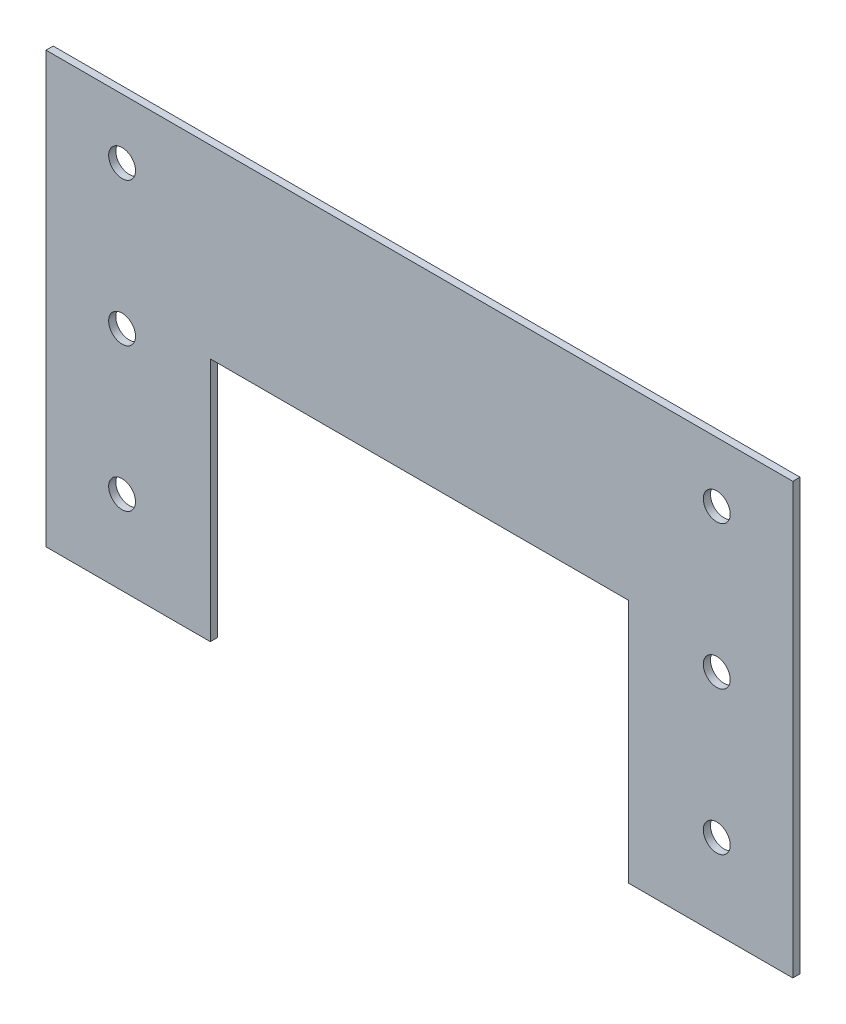
ISO-10303-21;
HEADER;
FILE_DESCRIPTION(('STEP AP214'),'2;1');
FILE_NAME('part.step','',(''),(''),'','','');
FILE_SCHEMA(('AUTOMOTIVE_DESIGN { 1 0 10303 214 1 1 1 1 }'));
ENDSEC;
DATA;
#1=APPLICATION_CONTEXT('core data for automotive mechanical design processes');
#2=APPLICATION_PROTOCOL_DEFINITION('international standard','automotive_design',2000,#1);
#3=PRODUCT_CONTEXT('',#1,'mechanical');
#4=PRODUCT('Part','Part','',(#3));
#5=PRODUCT_RELATED_PRODUCT_CATEGORY('part','',(#4));
#6=PRODUCT_DEFINITION_FORMATION('','',#4);
#7=PRODUCT_DEFINITION_CONTEXT('part definition',#1,'design');
#8=PRODUCT_DEFINITION('design','',#6,#7);
#9=PRODUCT_DEFINITION_SHAPE('','',#8);
#10=(LENGTH_UNIT() NAMED_UNIT(*) SI_UNIT(.MILLI.,.METRE.));
#11=(NAMED_UNIT(*) PLANE_ANGLE_UNIT() SI_UNIT($,.RADIAN.));
#12=(NAMED_UNIT(*) SI_UNIT($,.STERADIAN.) SOLID_ANGLE_UNIT());
#13=UNCERTAINTY_MEASURE_WITH_UNIT(LENGTH_MEASURE(1.E-05),#10,'distance_accuracy_value','');
#14=(GEOMETRIC_REPRESENTATION_CONTEXT(3) GLOBAL_UNCERTAINTY_ASSIGNED_CONTEXT((#13)) GLOBAL_UNIT_ASSIGNED_CONTEXT((#10,
#11,#12)) REPRESENTATION_CONTEXT('',''));
#15=CARTESIAN_POINT('',(0.,0.,0.));
#16=DIRECTION('',(0.,0.,1.));
#17=DIRECTION('',(1.,0.,0.));
#18=AXIS2_PLACEMENT_3D('',#15,#16,#17);
#19=CARTESIAN_POINT('',(0.,0.,-1.2));
#20=DIRECTION('',(-1.,0.,0.));
#21=DIRECTION('',(0.,0.,1.));
#22=AXIS2_PLACEMENT_3D('',#19,#20,#21);
#23=PLANE('',#22);
#24=DIRECTION('',(0.,-1.,0.));
#25=VECTOR('',#24,1.);
#26=CARTESIAN_POINT('',(0.,0.,0.));
#27=LINE('',#26,#25);
#28=CARTESIAN_POINT('',(0.,72.,0.));
#29=VERTEX_POINT('',#28);
#30=CARTESIAN_POINT('',(0.,0.,0.));
#31=VERTEX_POINT('',#30);
#32=EDGE_CURVE('E136',#29,#31,#27,.T.);
#33=ORIENTED_EDGE('',*,*,#32,.F.);
#34=DIRECTION('',(0.,0.,1.));
#35=VECTOR('',#34,1.);
#36=CARTESIAN_POINT('',(0.,72.,-1.2));
#37=LINE('',#36,#35);
#38=CARTESIAN_POINT('',(0.,72.,-1.2));
#39=VERTEX_POINT('',#38);
#40=EDGE_CURVE('E11',#39,#29,#37,.T.);
#41=ORIENTED_EDGE('',*,*,#40,.F.);
#42=DIRECTION('',(0.,-1.,0.));
#43=VECTOR('',#42,1.);
#44=CARTESIAN_POINT('',(0.,0.,-1.2));
#45=LINE('',#44,#43);
#46=CARTESIAN_POINT('',(0.,0.,-1.2));
#47=VERTEX_POINT('',#46);
#48=EDGE_CURVE('E157',#39,#47,#45,.T.);
#49=ORIENTED_EDGE('',*,*,#48,.T.);
#50=DIRECTION('',(0.,0.,1.));
#51=VECTOR('',#50,1.);
#52=CARTESIAN_POINT('',(0.,0.,-1.2));
#53=LINE('',#52,#51);
#54=EDGE_CURVE('E42',#47,#31,#53,.T.);
#55=ORIENTED_EDGE('',*,*,#54,.T.);
#56=EDGE_LOOP('',(#33,#41,#49,#55));
#57=FACE_BOUND('',#56,.T.);
#58=ADVANCED_FACE('F39',(#57),#23,.T.);
#59=CARTESIAN_POINT('',(0.,72.,-1.2));
#60=DIRECTION('',(0.,1.,0.));
#61=DIRECTION('',(0.,0.,1.));
#62=AXIS2_PLACEMENT_3D('',#59,#60,#61);
#63=PLANE('',#62);
#64=DIRECTION('',(-1.,0.,0.));
#65=VECTOR('',#64,1.);
#66=CARTESIAN_POINT('',(0.,72.,0.));
#67=LINE('',#66,#65);
#68=CARTESIAN_POINT('',(125.,72.,0.));
#69=VERTEX_POINT('',#68);
#70=EDGE_CURVE('E155',#69,#29,#67,.T.);
#71=ORIENTED_EDGE('',*,*,#70,.F.);
#72=DIRECTION('',(0.,0.,1.));
#73=VECTOR('',#72,1.);
#74=CARTESIAN_POINT('',(125.,72.,-1.2));
#75=LINE('',#74,#73);
#76=CARTESIAN_POINT('',(125.,72.,-1.2));
#77=VERTEX_POINT('',#76);
#78=EDGE_CURVE('E48',#77,#69,#75,.T.);
#79=ORIENTED_EDGE('',*,*,#78,.F.);
#80=DIRECTION('',(-1.,0.,0.));
#81=VECTOR('',#80,1.);
#82=CARTESIAN_POINT('',(0.,72.,-1.2));
#83=LINE('',#82,#81);
#84=EDGE_CURVE('E126',#77,#39,#83,.T.);
#85=ORIENTED_EDGE('',*,*,#84,.T.);
#86=ORIENTED_EDGE('',*,*,#40,.T.);
#87=EDGE_LOOP('',(#71,#79,#85,#86));
#88=FACE_BOUND('',#87,.T.);
#89=ADVANCED_FACE('F169',(#88),#63,.T.);
#90=CARTESIAN_POINT('',(125.,0.,-1.2));
#91=DIRECTION('',(1.,0.,0.));
#92=DIRECTION('',(0.,0.,-1.));
#93=AXIS2_PLACEMENT_3D('',#90,#91,#92);
#94=PLANE('',#93);
#95=DIRECTION('',(0.,1.,0.));
#96=VECTOR('',#95,1.);
#97=CARTESIAN_POINT('',(125.,0.,0.));
#98=LINE('',#97,#96);
#99=CARTESIAN_POINT('',(125.,0.,0.));
#100=VERTEX_POINT('',#99);
#101=EDGE_CURVE('E113',#100,#69,#98,.T.);
#102=ORIENTED_EDGE('',*,*,#101,.F.);
#103=DIRECTION('',(0.,0.,1.));
#104=VECTOR('',#103,1.);
#105=CARTESIAN_POINT('',(125.,0.,-1.2));
#106=LINE('',#105,#104);
#107=CARTESIAN_POINT('',(125.,0.,-1.2));
#108=VERTEX_POINT('',#107);
#109=EDGE_CURVE('E108',#108,#100,#106,.T.);
#110=ORIENTED_EDGE('',*,*,#109,.F.);
#111=DIRECTION('',(0.,1.,0.));
#112=VECTOR('',#111,1.);
#113=CARTESIAN_POINT('',(125.,0.,-1.2));
#114=LINE('',#113,#112);
#115=EDGE_CURVE('E111',#108,#77,#114,.T.);
#116=ORIENTED_EDGE('',*,*,#115,.T.);
#117=ORIENTED_EDGE('',*,*,#78,.T.);
#118=EDGE_LOOP('',(#102,#110,#116,#117));
#119=FACE_BOUND('',#118,.T.);
#120=ADVANCED_FACE('F110',(#119),#94,.T.);
#121=CARTESIAN_POINT('',(97.5,0.,-1.2));
#122=DIRECTION('',(0.,-1.,0.));
#123=DIRECTION('',(1.,0.,0.));
#124=AXIS2_PLACEMENT_3D('',#121,#122,#123);
#125=PLANE('',#124);
#126=DIRECTION('',(1.,0.,0.));
#127=VECTOR('',#126,1.);
#128=CARTESIAN_POINT('',(97.5,0.,0.));
#129=LINE('',#128,#127);
#130=CARTESIAN_POINT('',(97.5,0.,0.));
#131=VERTEX_POINT('',#130);
#132=EDGE_CURVE('E152',#131,#100,#129,.T.);
#133=ORIENTED_EDGE('',*,*,#132,.F.);
#134=DIRECTION('',(0.,0.,1.));
#135=VECTOR('',#134,1.);
#136=CARTESIAN_POINT('',(97.5,0.,-1.2));
#137=LINE('',#136,#135);
#138=CARTESIAN_POINT('',(97.5,0.,-1.2));
#139=VERTEX_POINT('',#138);
#140=EDGE_CURVE('E118',#139,#131,#137,.T.);
#141=ORIENTED_EDGE('',*,*,#140,.F.);
#142=DIRECTION('',(1.,0.,0.));
#143=VECTOR('',#142,1.);
#144=CARTESIAN_POINT('',(97.5,0.,-1.2));
#145=LINE('',#144,#143);
#146=EDGE_CURVE('E124',#139,#108,#145,.T.);
#147=ORIENTED_EDGE('',*,*,#146,.T.);
#148=ORIENTED_EDGE('',*,*,#109,.T.);
#149=EDGE_LOOP('',(#133,#141,#147,#148));
#150=FACE_BOUND('',#149,.T.);
#151=ADVANCED_FACE('F128',(#150),#125,.T.);
#152=CARTESIAN_POINT('',(97.5,0.,-1.2));
#153=DIRECTION('',(-1.,0.,0.));
#154=DIRECTION('',(0.,-1.,0.));
#155=AXIS2_PLACEMENT_3D('',#152,#153,#154);
#156=PLANE('',#155);
#157=DIRECTION('',(0.,-1.,0.));
#158=VECTOR('',#157,1.);
#159=CARTESIAN_POINT('',(97.5,0.,0.));
#160=LINE('',#159,#158);
#161=CARTESIAN_POINT('',(97.5,41.,0.));
#162=VERTEX_POINT('',#161);
#163=EDGE_CURVE('E149',#162,#131,#160,.T.);
#164=ORIENTED_EDGE('',*,*,#163,.F.);
#165=DIRECTION('',(0.,0.,1.));
#166=VECTOR('',#165,1.);
#167=CARTESIAN_POINT('',(97.5,41.,-1.2));
#168=LINE('',#167,#166);
#169=CARTESIAN_POINT('',(97.5,41.,-1.2));
#170=VERTEX_POINT('',#169);
#171=EDGE_CURVE('E161',#170,#162,#168,.T.);
#172=ORIENTED_EDGE('',*,*,#171,.F.);
#173=DIRECTION('',(0.,-1.,0.));
#174=VECTOR('',#173,1.);
#175=CARTESIAN_POINT('',(97.5,0.,-1.2));
#176=LINE('',#175,#174);
#177=EDGE_CURVE('E129',#170,#139,#176,.T.);
#178=ORIENTED_EDGE('',*,*,#177,.T.);
#179=ORIENTED_EDGE('',*,*,#140,.T.);
#180=EDGE_LOOP('',(#164,#172,#178,#179));
#181=FACE_BOUND('',#180,.T.);
#182=ADVANCED_FACE('F182',(#181),#156,.T.);
#183=CARTESIAN_POINT('',(97.5,41.,-1.2));
#184=DIRECTION('',(0.,-1.,0.));
#185=DIRECTION('',(1.,0.,0.));
#186=AXIS2_PLACEMENT_3D('',#183,#184,#185);
#187=PLANE('',#186);
#188=DIRECTION('',(1.,0.,0.));
#189=VECTOR('',#188,1.);
#190=CARTESIAN_POINT('',(97.5,41.,0.));
#191=LINE('',#190,#189);
#192=CARTESIAN_POINT('',(27.5,41.,0.));
#193=VERTEX_POINT('',#192);
#194=EDGE_CURVE('E146',#193,#162,#191,.T.);
#195=ORIENTED_EDGE('',*,*,#194,.F.);
#196=DIRECTION('',(0.,0.,1.));
#197=VECTOR('',#196,1.);
#198=CARTESIAN_POINT('',(27.5,41.,-1.2));
#199=LINE('',#198,#197);
#200=CARTESIAN_POINT('',(27.5,41.,-1.2));
#201=VERTEX_POINT('',#200);
#202=EDGE_CURVE('E163',#201,#193,#199,.T.);
#203=ORIENTED_EDGE('',*,*,#202,.F.);
#204=DIRECTION('',(1.,0.,0.));
#205=VECTOR('',#204,1.);
#206=CARTESIAN_POINT('',(97.5,41.,-1.2));
#207=LINE('',#206,#205);
#208=EDGE_CURVE('E131',#201,#170,#207,.T.);
#209=ORIENTED_EDGE('',*,*,#208,.T.);
#210=ORIENTED_EDGE('',*,*,#171,.T.);
#211=EDGE_LOOP('',(#195,#203,#209,#210));
#212=FACE_BOUND('',#211,.T.);
#213=ADVANCED_FACE('F185',(#212),#187,.T.);
#214=CARTESIAN_POINT('',(27.5,0.,-1.2));
#215=DIRECTION('',(1.,0.,0.));
#216=DIRECTION('',(0.,1.,0.));
#217=AXIS2_PLACEMENT_3D('',#214,#215,#216);
#218=PLANE('',#217);
#219=DIRECTION('',(0.,1.,0.));
#220=VECTOR('',#219,1.);
#221=CARTESIAN_POINT('',(27.5,0.,0.));
#222=LINE('',#221,#220);
#223=CARTESIAN_POINT('',(27.5,0.,0.));
#224=VERTEX_POINT('',#223);
#225=EDGE_CURVE('E143',#224,#193,#222,.T.);
#226=ORIENTED_EDGE('',*,*,#225,.F.);
#227=DIRECTION('',(0.,0.,1.));
#228=VECTOR('',#227,1.);
#229=CARTESIAN_POINT('',(27.5,0.,-1.2));
#230=LINE('',#229,#228);
#231=CARTESIAN_POINT('',(27.5,0.,-1.2));
#232=VERTEX_POINT('',#231);
#233=EDGE_CURVE('E164',#232,#224,#230,.T.);
#234=ORIENTED_EDGE('',*,*,#233,.F.);
#235=DIRECTION('',(0.,1.,0.));
#236=VECTOR('',#235,1.);
#237=CARTESIAN_POINT('',(27.5,0.,-1.2));
#238=LINE('',#237,#236);
#239=EDGE_CURVE('E271',#232,#201,#238,.T.);
#240=ORIENTED_EDGE('',*,*,#239,.T.);
#241=ORIENTED_EDGE('',*,*,#202,.T.);
#242=EDGE_LOOP('',(#226,#234,#240,#241));
#243=FACE_BOUND('',#242,.T.);
#244=ADVANCED_FACE('F189',(#243),#218,.T.);
#245=CARTESIAN_POINT('',(0.,0.,-1.2));
#246=DIRECTION('',(0.,-1.,0.));
#247=DIRECTION('',(0.,0.,-1.));
#248=AXIS2_PLACEMENT_3D('',#245,#246,#247);
#249=PLANE('',#248);
#250=DIRECTION('',(1.,0.,0.));
#251=VECTOR('',#250,1.);
#252=CARTESIAN_POINT('',(0.,0.,0.));
#253=LINE('',#252,#251);
#254=EDGE_CURVE('E139',#31,#224,#253,.T.);
#255=ORIENTED_EDGE('',*,*,#254,.F.);
#256=ORIENTED_EDGE('',*,*,#54,.F.);
#257=DIRECTION('',(1.,0.,0.));
#258=VECTOR('',#257,1.);
#259=CARTESIAN_POINT('',(0.,0.,-1.2));
#260=LINE('',#259,#258);
#261=EDGE_CURVE('E269',#47,#232,#260,.T.);
#262=ORIENTED_EDGE('',*,*,#261,.T.);
#263=ORIENTED_EDGE('',*,*,#233,.T.);
#264=EDGE_LOOP('',(#255,#256,#262,#263));
#265=FACE_BOUND('',#264,.T.);
#266=ADVANCED_FACE('F166',(#265),#249,.T.);
#267=CARTESIAN_POINT('',(0.,0.,-1.2));
#268=DIRECTION('',(0.,0.,-1.));
#269=DIRECTION('',(-1.,0.,0.));
#270=AXIS2_PLACEMENT_3D('',#267,#268,#269);
#271=PLANE('',#270);
#272=CARTESIAN_POINT('',(12.7316999999991,14.0000000000003,-1.2));
#273=DIRECTION('',(0.,0.,1.));
#274=DIRECTION('',(1.,0.,0.));
#275=AXIS2_PLACEMENT_3D('',#272,#273,#274);
#276=CIRCLE('',#275,2.25);
#277=CARTESIAN_POINT('',(14.9816999999991,14.0000000000003,-1.2));
#278=VERTEX_POINT('',#277);
#279=EDGE_CURVE('E232',#278,#278,#276,.T.);
#280=ORIENTED_EDGE('',*,*,#279,.T.);
#281=EDGE_LOOP('',(#280));
#282=FACE_BOUND('',#281,.T.);
#283=CARTESIAN_POINT('',(12.7316999999991,38.0000000000001,-1.2));
#284=DIRECTION('',(0.,0.,1.));
#285=DIRECTION('',(1.,0.,0.));
#286=AXIS2_PLACEMENT_3D('',#283,#284,#285);
#287=CIRCLE('',#286,2.25);
#288=CARTESIAN_POINT('',(14.9816999999991,38.0000000000001,-1.2));
#289=VERTEX_POINT('',#288);
#290=EDGE_CURVE('E240',#289,#289,#287,.T.);
#291=ORIENTED_EDGE('',*,*,#290,.T.);
#292=EDGE_LOOP('',(#291));
#293=FACE_BOUND('',#292,.T.);
#294=CARTESIAN_POINT('',(12.7316999999991,62.,-1.2));
#295=DIRECTION('',(0.,0.,1.));
#296=DIRECTION('',(1.,0.,0.));
#297=AXIS2_PLACEMENT_3D('',#294,#295,#296);
#298=CIRCLE('',#297,2.25);
#299=CARTESIAN_POINT('',(14.9816999999991,62.,-1.2));
#300=VERTEX_POINT('',#299);
#301=EDGE_CURVE('E246',#300,#300,#298,.T.);
#302=ORIENTED_EDGE('',*,*,#301,.T.);
#303=EDGE_LOOP('',(#302));
#304=FACE_BOUND('',#303,.T.);
#305=CARTESIAN_POINT('',(112.2683,14.0000000000003,-1.2));
#306=DIRECTION('',(0.,0.,1.));
#307=DIRECTION('',(1.,0.,0.));
#308=AXIS2_PLACEMENT_3D('',#305,#306,#307);
#309=CIRCLE('',#308,2.25);
#310=CARTESIAN_POINT('',(114.5183,14.0000000000003,-1.2));
#311=VERTEX_POINT('',#310);
#312=EDGE_CURVE('E252',#311,#311,#309,.T.);
#313=ORIENTED_EDGE('',*,*,#312,.T.);
#314=EDGE_LOOP('',(#313));
#315=FACE_BOUND('',#314,.T.);
#316=CARTESIAN_POINT('',(112.2683,38.0000000000001,-1.2));
#317=DIRECTION('',(0.,0.,1.));
#318=DIRECTION('',(1.,0.,0.));
#319=AXIS2_PLACEMENT_3D('',#316,#317,#318);
#320=CIRCLE('',#319,2.25);
#321=CARTESIAN_POINT('',(114.5183,38.0000000000001,-1.2));
#322=VERTEX_POINT('',#321);
#323=EDGE_CURVE('E258',#322,#322,#320,.T.);
#324=ORIENTED_EDGE('',*,*,#323,.T.);
#325=EDGE_LOOP('',(#324));
#326=FACE_BOUND('',#325,.T.);
#327=CARTESIAN_POINT('',(112.2683,62.,-1.2));
#328=DIRECTION('',(0.,0.,1.));
#329=DIRECTION('',(1.,0.,0.));
#330=AXIS2_PLACEMENT_3D('',#327,#328,#329);
#331=CIRCLE('',#330,2.24999999999999);
#332=CARTESIAN_POINT('',(114.5183,62.,-1.2));
#333=VERTEX_POINT('',#332);
#334=EDGE_CURVE('E140',#333,#333,#331,.T.);
#335=ORIENTED_EDGE('',*,*,#334,.T.);
#336=EDGE_LOOP('',(#335));
#337=FACE_BOUND('',#336,.T.);
#338=ORIENTED_EDGE('',*,*,#48,.F.);
#339=ORIENTED_EDGE('',*,*,#84,.F.);
#340=ORIENTED_EDGE('',*,*,#115,.F.);
#341=ORIENTED_EDGE('',*,*,#146,.F.);
#342=ORIENTED_EDGE('',*,*,#177,.F.);
#343=ORIENTED_EDGE('',*,*,#208,.F.);
#344=ORIENTED_EDGE('',*,*,#239,.F.);
#345=ORIENTED_EDGE('',*,*,#261,.F.);
#346=EDGE_LOOP('',(#338,#339,#340,#341,#342,#343,#344,#345));
#347=FACE_BOUND('',#346,.T.);
#348=ADVANCED_FACE('F122',(#282,#293,#304,#315,#326,#337,#347),#271,.T.);
#349=CARTESIAN_POINT('',(0.,0.,0.));
#350=DIRECTION('',(0.,0.,-1.));
#351=DIRECTION('',(-1.,0.,0.));
#352=AXIS2_PLACEMENT_3D('',#349,#350,#351);
#353=PLANE('',#352);
#354=CARTESIAN_POINT('',(12.7316999999991,14.0000000000003,0.));
#355=DIRECTION('',(0.,0.,1.));
#356=DIRECTION('',(1.,0.,0.));
#357=AXIS2_PLACEMENT_3D('',#354,#355,#356);
#358=CIRCLE('',#357,2.25);
#359=CARTESIAN_POINT('',(14.9816999999991,14.0000000000003,0.));
#360=VERTEX_POINT('',#359);
#361=EDGE_CURVE('E235',#360,#360,#358,.T.);
#362=ORIENTED_EDGE('',*,*,#361,.F.);
#363=EDGE_LOOP('',(#362));
#364=FACE_BOUND('',#363,.T.);
#365=CARTESIAN_POINT('',(12.7316999999991,38.0000000000001,0.));
#366=DIRECTION('',(0.,0.,1.));
#367=DIRECTION('',(1.,0.,0.));
#368=AXIS2_PLACEMENT_3D('',#365,#366,#367);
#369=CIRCLE('',#368,2.25);
#370=CARTESIAN_POINT('',(14.9816999999991,38.0000000000001,0.));
#371=VERTEX_POINT('',#370);
#372=EDGE_CURVE('E237',#371,#371,#369,.T.);
#373=ORIENTED_EDGE('',*,*,#372,.F.);
#374=EDGE_LOOP('',(#373));
#375=FACE_BOUND('',#374,.T.);
#376=CARTESIAN_POINT('',(12.7316999999991,62.,0.));
#377=DIRECTION('',(0.,0.,1.));
#378=DIRECTION('',(1.,0.,0.));
#379=AXIS2_PLACEMENT_3D('',#376,#377,#378);
#380=CIRCLE('',#379,2.25);
#381=CARTESIAN_POINT('',(14.9816999999991,62.,0.));
#382=VERTEX_POINT('',#381);
#383=EDGE_CURVE('E243',#382,#382,#380,.T.);
#384=ORIENTED_EDGE('',*,*,#383,.F.);
#385=EDGE_LOOP('',(#384));
#386=FACE_BOUND('',#385,.T.);
#387=CARTESIAN_POINT('',(112.2683,14.0000000000003,0.));
#388=DIRECTION('',(0.,0.,1.));
#389=DIRECTION('',(1.,0.,0.));
#390=AXIS2_PLACEMENT_3D('',#387,#388,#389);
#391=CIRCLE('',#390,2.25);
#392=CARTESIAN_POINT('',(114.5183,14.0000000000003,0.));
#393=VERTEX_POINT('',#392);
#394=EDGE_CURVE('E249',#393,#393,#391,.T.);
#395=ORIENTED_EDGE('',*,*,#394,.F.);
#396=EDGE_LOOP('',(#395));
#397=FACE_BOUND('',#396,.T.);
#398=CARTESIAN_POINT('',(112.2683,38.0000000000001,0.));
#399=DIRECTION('',(0.,0.,1.));
#400=DIRECTION('',(1.,0.,0.));
#401=AXIS2_PLACEMENT_3D('',#398,#399,#400);
#402=CIRCLE('',#401,2.25);
#403=CARTESIAN_POINT('',(114.5183,38.0000000000001,0.));
#404=VERTEX_POINT('',#403);
#405=EDGE_CURVE('E255',#404,#404,#402,.T.);
#406=ORIENTED_EDGE('',*,*,#405,.F.);
#407=EDGE_LOOP('',(#406));
#408=FACE_BOUND('',#407,.T.);
#409=CARTESIAN_POINT('',(112.2683,62.,0.));
#410=DIRECTION('',(0.,0.,1.));
#411=DIRECTION('',(1.,0.,0.));
#412=AXIS2_PLACEMENT_3D('',#409,#410,#411);
#413=CIRCLE('',#412,2.24999999999999);
#414=CARTESIAN_POINT('',(114.5183,62.,0.));
#415=VERTEX_POINT('',#414);
#416=EDGE_CURVE('E261',#415,#415,#413,.T.);
#417=ORIENTED_EDGE('',*,*,#416,.F.);
#418=EDGE_LOOP('',(#417));
#419=FACE_BOUND('',#418,.T.);
#420=ORIENTED_EDGE('',*,*,#32,.T.);
#421=ORIENTED_EDGE('',*,*,#254,.T.);
#422=ORIENTED_EDGE('',*,*,#225,.T.);
#423=ORIENTED_EDGE('',*,*,#194,.T.);
#424=ORIENTED_EDGE('',*,*,#163,.T.);
#425=ORIENTED_EDGE('',*,*,#132,.T.);
#426=ORIENTED_EDGE('',*,*,#101,.T.);
#427=ORIENTED_EDGE('',*,*,#70,.T.);
#428=EDGE_LOOP('',(#420,#421,#422,#423,#424,#425,#426,#427));
#429=FACE_BOUND('',#428,.T.);
#430=ADVANCED_FACE('F168',(#364,#375,#386,#397,#408,#419,#429),#353,.F.);
#431=CARTESIAN_POINT('',(112.2683,62.,-1.2));
#432=DIRECTION('',(0.,0.,1.));
#433=DIRECTION('',(1.,0.,0.));
#434=AXIS2_PLACEMENT_3D('',#431,#432,#433);
#435=CYLINDRICAL_SURFACE('',#434,2.24999999999999);
#436=ORIENTED_EDGE('',*,*,#334,.F.);
#437=EDGE_LOOP('',(#436));
#438=FACE_BOUND('',#437,.T.);
#439=ORIENTED_EDGE('',*,*,#416,.T.);
#440=EDGE_LOOP('',(#439));
#441=FACE_BOUND('',#440,.T.);
#442=ADVANCED_FACE('F201',(#438,#441),#435,.F.);
#443=CARTESIAN_POINT('',(112.2683,38.0000000000001,-1.2));
#444=DIRECTION('',(0.,0.,1.));
#445=DIRECTION('',(1.,0.,0.));
#446=AXIS2_PLACEMENT_3D('',#443,#444,#445);
#447=CYLINDRICAL_SURFACE('',#446,2.25);
#448=ORIENTED_EDGE('',*,*,#323,.F.);
#449=EDGE_LOOP('',(#448));
#450=FACE_BOUND('',#449,.T.);
#451=ORIENTED_EDGE('',*,*,#405,.T.);
#452=EDGE_LOOP('',(#451));
#453=FACE_BOUND('',#452,.T.);
#454=ADVANCED_FACE('F208',(#450,#453),#447,.F.);
#455=CARTESIAN_POINT('',(112.2683,14.0000000000003,-1.2));
#456=DIRECTION('',(0.,0.,1.));
#457=DIRECTION('',(1.,0.,0.));
#458=AXIS2_PLACEMENT_3D('',#455,#456,#457);
#459=CYLINDRICAL_SURFACE('',#458,2.25);
#460=ORIENTED_EDGE('',*,*,#312,.F.);
#461=EDGE_LOOP('',(#460));
#462=FACE_BOUND('',#461,.T.);
#463=ORIENTED_EDGE('',*,*,#394,.T.);
#464=EDGE_LOOP('',(#463));
#465=FACE_BOUND('',#464,.T.);
#466=ADVANCED_FACE('F212',(#462,#465),#459,.F.);
#467=CARTESIAN_POINT('',(12.7316999999991,62.,-1.2));
#468=DIRECTION('',(0.,0.,1.));
#469=DIRECTION('',(1.,0.,0.));
#470=AXIS2_PLACEMENT_3D('',#467,#468,#469);
#471=CYLINDRICAL_SURFACE('',#470,2.25);
#472=ORIENTED_EDGE('',*,*,#301,.F.);
#473=EDGE_LOOP('',(#472));
#474=FACE_BOUND('',#473,.T.);
#475=ORIENTED_EDGE('',*,*,#383,.T.);
#476=EDGE_LOOP('',(#475));
#477=FACE_BOUND('',#476,.T.);
#478=ADVANCED_FACE('F216',(#474,#477),#471,.F.);
#479=CARTESIAN_POINT('',(12.7316999999991,38.0000000000001,-1.2));
#480=DIRECTION('',(0.,0.,1.));
#481=DIRECTION('',(1.,0.,0.));
#482=AXIS2_PLACEMENT_3D('',#479,#480,#481);
#483=CYLINDRICAL_SURFACE('',#482,2.25);
#484=ORIENTED_EDGE('',*,*,#290,.F.);
#485=EDGE_LOOP('',(#484));
#486=FACE_BOUND('',#485,.T.);
#487=ORIENTED_EDGE('',*,*,#372,.T.);
#488=EDGE_LOOP('',(#487));
#489=FACE_BOUND('',#488,.T.);
#490=ADVANCED_FACE('F220',(#486,#489),#483,.F.);
#491=CARTESIAN_POINT('',(12.7316999999991,14.0000000000003,-1.2));
#492=DIRECTION('',(0.,0.,1.));
#493=DIRECTION('',(1.,0.,0.));
#494=AXIS2_PLACEMENT_3D('',#491,#492,#493);
#495=CYLINDRICAL_SURFACE('',#494,2.25);
#496=ORIENTED_EDGE('',*,*,#279,.F.);
#497=EDGE_LOOP('',(#496));
#498=FACE_BOUND('',#497,.T.);
#499=ORIENTED_EDGE('',*,*,#361,.T.);
#500=EDGE_LOOP('',(#499));
#501=FACE_BOUND('',#500,.T.);
#502=ADVANCED_FACE('F224',(#498,#501),#495,.F.);
#503=CLOSED_SHELL('',(#58,#89,#120,#151,#182,#213,#244,#266,#348,#430,#442,#454,#466,#478,#490,#502));
#504=MANIFOLD_SOLID_BREP('B2',#503);
#505=ADVANCED_BREP_SHAPE_REPRESENTATION('',(#18,#504),#14);
#506=SHAPE_DEFINITION_REPRESENTATION(#9,#505);
ENDSEC;
END-ISO-10303-21;
